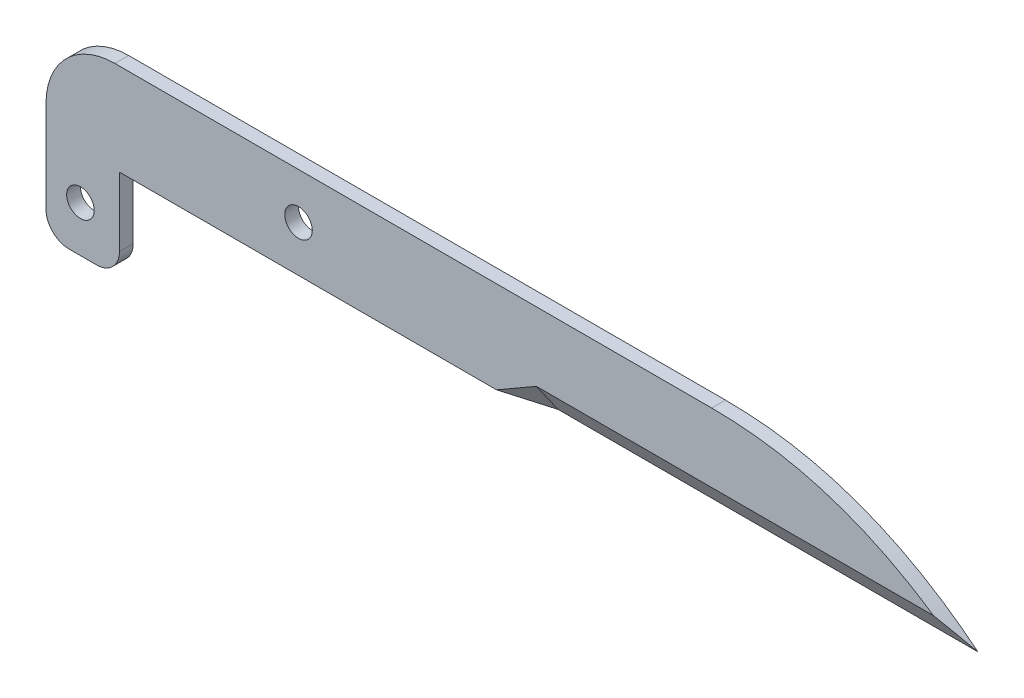
ISO-10303-21;
HEADER;
FILE_DESCRIPTION(('STEP AP214'),'2;1');
FILE_NAME('part.step','',(''),(''),'','','');
FILE_SCHEMA(('AUTOMOTIVE_DESIGN { 1 0 10303 214 1 1 1 1 }'));
ENDSEC;
DATA;
#1=APPLICATION_CONTEXT('core data for automotive mechanical design processes');
#2=APPLICATION_PROTOCOL_DEFINITION('international standard','automotive_design',2000,#1);
#3=PRODUCT_CONTEXT('',#1,'mechanical');
#4=PRODUCT('Part','Part','',(#3));
#5=PRODUCT_RELATED_PRODUCT_CATEGORY('part','',(#4));
#6=PRODUCT_DEFINITION_FORMATION('','',#4);
#7=PRODUCT_DEFINITION_CONTEXT('part definition',#1,'design');
#8=PRODUCT_DEFINITION('design','',#6,#7);
#9=PRODUCT_DEFINITION_SHAPE('','',#8);
#10=(LENGTH_UNIT() NAMED_UNIT(*) SI_UNIT(.MILLI.,.METRE.));
#11=(NAMED_UNIT(*) PLANE_ANGLE_UNIT() SI_UNIT($,.RADIAN.));
#12=(NAMED_UNIT(*) SI_UNIT($,.STERADIAN.) SOLID_ANGLE_UNIT());
#13=UNCERTAINTY_MEASURE_WITH_UNIT(LENGTH_MEASURE(1.E-05),#10,'distance_accuracy_value','');
#14=(GEOMETRIC_REPRESENTATION_CONTEXT(3) GLOBAL_UNCERTAINTY_ASSIGNED_CONTEXT((#13)) GLOBAL_UNIT_ASSIGNED_CONTEXT((#10,
#11,#12)) REPRESENTATION_CONTEXT('',''));
#15=CARTESIAN_POINT('',(0.,0.,0.));
#16=DIRECTION('',(0.,0.,1.));
#17=DIRECTION('',(1.,0.,0.));
#18=AXIS2_PLACEMENT_3D('',#15,#16,#17);
#19=CARTESIAN_POINT('',(-100.,-10.,3.));
#20=DIRECTION('',(1.,0.,0.));
#21=DIRECTION('',(0.,0.,-1.));
#22=AXIS2_PLACEMENT_3D('',#19,#20,#21);
#23=PLANE('',#22);
#24=DIRECTION('',(0.,-1.,0.));
#25=VECTOR('',#24,1.);
#26=CARTESIAN_POINT('',(-100.,-10.,0.));
#27=LINE('',#26,#25);
#28=CARTESIAN_POINT('',(-100.,-5.00000000000001,0.));
#29=VERTEX_POINT('',#28);
#30=CARTESIAN_POINT('',(-100.,-25.,0.));
#31=VERTEX_POINT('',#30);
#32=EDGE_CURVE('E131',#29,#31,#27,.T.);
#33=ORIENTED_EDGE('',*,*,#32,.T.);
#34=DIRECTION('',(0.,0.,1.));
#35=VECTOR('',#34,1.);
#36=CARTESIAN_POINT('',(-100.,-25.,3.));
#37=LINE('',#36,#35);
#38=CARTESIAN_POINT('',(-100.,-25.,3.));
#39=VERTEX_POINT('',#38);
#40=EDGE_CURVE('E198',#31,#39,#37,.T.);
#41=ORIENTED_EDGE('',*,*,#40,.T.);
#42=DIRECTION('',(0.,-1.,0.));
#43=VECTOR('',#42,1.);
#44=CARTESIAN_POINT('',(-100.,-10.,3.));
#45=LINE('',#44,#43);
#46=CARTESIAN_POINT('',(-100.,-5.00000000000001,3.));
#47=VERTEX_POINT('',#46);
#48=EDGE_CURVE('E227',#47,#39,#45,.T.);
#49=ORIENTED_EDGE('',*,*,#48,.F.);
#50=DIRECTION('',(0.,0.,-1.));
#51=VECTOR('',#50,1.);
#52=CARTESIAN_POINT('',(-100.,-5.00000000000001,3.));
#53=LINE('',#52,#51);
#54=EDGE_CURVE('E180',#47,#29,#53,.T.);
#55=ORIENTED_EDGE('',*,*,#54,.T.);
#56=EDGE_LOOP('',(#33,#41,#49,#55));
#57=FACE_BOUND('',#56,.T.);
#58=ADVANCED_FACE('F36',(#57),#23,.F.);
#59=CARTESIAN_POINT('',(100.,-9.99999999999999,3.));
#60=DIRECTION('',(0.,1.,0.));
#61=DIRECTION('',(-1.,0.,0.));
#62=AXIS2_PLACEMENT_3D('',#59,#60,#61);
#63=PLANE('',#62);
#64=DIRECTION('',(1.,0.,0.));
#65=VECTOR('',#64,1.);
#66=CARTESIAN_POINT('',(100.,-9.99999999999999,3.));
#67=LINE('',#66,#65);
#68=CARTESIAN_POINT('',(-84.,-10.,3.));
#69=VERTEX_POINT('',#68);
#70=CARTESIAN_POINT('',(-1.85640646055144,-10.,3.));
#71=VERTEX_POINT('',#70);
#72=EDGE_CURVE('E135',#69,#71,#67,.T.);
#73=ORIENTED_EDGE('',*,*,#72,.F.);
#74=DIRECTION('',(0.,0.,1.));
#75=VECTOR('',#74,1.);
#76=CARTESIAN_POINT('',(-84.,-10.,0.));
#77=LINE('',#76,#75);
#78=CARTESIAN_POINT('',(-84.,-10.,0.));
#79=VERTEX_POINT('',#78);
#80=EDGE_CURVE('E118',#79,#69,#77,.T.);
#81=ORIENTED_EDGE('',*,*,#80,.F.);
#82=DIRECTION('',(1.,0.,0.));
#83=VECTOR('',#82,1.);
#84=CARTESIAN_POINT('',(100.,-9.99999999999999,0.));
#85=LINE('',#84,#83);
#86=CARTESIAN_POINT('',(8.53589838486205,-10.,0.));
#87=VERTEX_POINT('',#86);
#88=EDGE_CURVE('E122',#79,#87,#85,.T.);
#89=ORIENTED_EDGE('',*,*,#88,.T.);
#90=DIRECTION('',(-0.960768922830524,0.,0.277350098112609));
#91=VECTOR('',#90,1.);
#92=CARTESIAN_POINT('',(7.68934801746655,-10.,0.244378041249178));
#93=LINE('',#92,#91);
#94=EDGE_CURVE('E283',#87,#71,#93,.T.);
#95=ORIENTED_EDGE('',*,*,#94,.T.);
#96=EDGE_LOOP('',(#73,#81,#89,#95));
#97=FACE_BOUND('',#96,.T.);
#98=ADVANCED_FACE('F134',(#97),#63,.F.);
#99=CARTESIAN_POINT('',(100.,10.,3.));
#100=DIRECTION('',(0.,-1.,0.));
#101=DIRECTION('',(1.,0.,0.));
#102=AXIS2_PLACEMENT_3D('',#99,#100,#101);
#103=PLANE('',#102);
#104=DIRECTION('',(-1.,0.,0.));
#105=VECTOR('',#104,1.);
#106=CARTESIAN_POINT('',(100.,10.,0.));
#107=LINE('',#106,#105);
#108=CARTESIAN_POINT('',(45.,10.,0.));
#109=VERTEX_POINT('',#108);
#110=CARTESIAN_POINT('',(-85.,9.99999999999999,0.));
#111=VERTEX_POINT('',#110);
#112=EDGE_CURVE('E130',#109,#111,#107,.T.);
#113=ORIENTED_EDGE('',*,*,#112,.T.);
#114=DIRECTION('',(0.,0.,-1.));
#115=VECTOR('',#114,1.);
#116=CARTESIAN_POINT('',(-85.,9.99999999999999,3.));
#117=LINE('',#116,#115);
#118=CARTESIAN_POINT('',(-85.,9.99999999999999,3.));
#119=VERTEX_POINT('',#118);
#120=EDGE_CURVE('E194',#111,#119,#117,.F.);
#121=ORIENTED_EDGE('',*,*,#120,.T.);
#122=DIRECTION('',(-1.,0.,0.));
#123=VECTOR('',#122,1.);
#124=CARTESIAN_POINT('',(100.,10.,3.));
#125=LINE('',#124,#123);
#126=CARTESIAN_POINT('',(45.,10.,3.));
#127=VERTEX_POINT('',#126);
#128=EDGE_CURVE('E280',#127,#119,#125,.T.);
#129=ORIENTED_EDGE('',*,*,#128,.F.);
#130=DIRECTION('',(0.,0.,1.));
#131=VECTOR('',#130,1.);
#132=CARTESIAN_POINT('',(45.,10.,0.));
#133=LINE('',#132,#131);
#134=EDGE_CURVE('E150',#109,#127,#133,.T.);
#135=ORIENTED_EDGE('',*,*,#134,.F.);
#136=EDGE_LOOP('',(#113,#121,#129,#135));
#137=FACE_BOUND('',#136,.T.);
#138=ADVANCED_FACE('F241',(#137),#103,.F.);
#139=CARTESIAN_POINT('',(0.,0.,3.));
#140=DIRECTION('',(0.,0.,1.));
#141=DIRECTION('',(1.,0.,0.));
#142=AXIS2_PLACEMENT_3D('',#139,#140,#141);
#143=PLANE('',#142);
#144=CARTESIAN_POINT('',(-92.5,-20.,3.));
#145=DIRECTION('',(0.,0.,1.));
#146=DIRECTION('',(1.,0.,0.));
#147=AXIS2_PLACEMENT_3D('',#144,#145,#146);
#148=CIRCLE('',#147,3.00000000000001);
#149=CARTESIAN_POINT('',(-89.5,-20.,3.));
#150=VERTEX_POINT('',#149);
#151=EDGE_CURVE('E189',#150,#150,#148,.T.);
#152=ORIENTED_EDGE('',*,*,#151,.F.);
#153=EDGE_LOOP('',(#152));
#154=FACE_BOUND('',#153,.T.);
#155=CARTESIAN_POINT('',(-45.,0.,3.));
#156=DIRECTION('',(0.,0.,1.));
#157=DIRECTION('',(1.,0.,0.));
#158=AXIS2_PLACEMENT_3D('',#155,#156,#157);
#159=CIRCLE('',#158,3.);
#160=CARTESIAN_POINT('',(-42.,0.,3.));
#161=VERTEX_POINT('',#160);
#162=EDGE_CURVE('E136',#161,#161,#159,.T.);
#163=ORIENTED_EDGE('',*,*,#162,.F.);
#164=EDGE_LOOP('',(#163));
#165=FACE_BOUND('',#164,.T.);
#166=ORIENTED_EDGE('',*,*,#48,.T.);
#167=CARTESIAN_POINT('',(-95.,-25.,3.));
#168=DIRECTION('',(0.,0.,1.));
#169=DIRECTION('',(1.,0.,0.));
#170=AXIS2_PLACEMENT_3D('',#167,#168,#169);
#171=CIRCLE('',#170,5.);
#172=CARTESIAN_POINT('',(-95.,-30.,3.));
#173=VERTEX_POINT('',#172);
#174=EDGE_CURVE('E203',#39,#173,#171,.T.);
#175=ORIENTED_EDGE('',*,*,#174,.T.);
#176=DIRECTION('',(1.,0.,0.));
#177=VECTOR('',#176,1.);
#178=CARTESIAN_POINT('',(-84.,-30.,3.));
#179=LINE('',#178,#177);
#180=CARTESIAN_POINT('',(-89.,-30.,3.));
#181=VERTEX_POINT('',#180);
#182=EDGE_CURVE('E188',#173,#181,#179,.T.);
#183=ORIENTED_EDGE('',*,*,#182,.T.);
#184=CARTESIAN_POINT('',(-89.,-25.,3.));
#185=DIRECTION('',(0.,0.,1.));
#186=DIRECTION('',(1.,0.,0.));
#187=AXIS2_PLACEMENT_3D('',#184,#185,#186);
#188=CIRCLE('',#187,5.);
#189=CARTESIAN_POINT('',(-84.,-25.,3.));
#190=VERTEX_POINT('',#189);
#191=EDGE_CURVE('E201',#181,#190,#188,.T.);
#192=ORIENTED_EDGE('',*,*,#191,.T.);
#193=DIRECTION('',(0.,1.,0.));
#194=VECTOR('',#193,1.);
#195=CARTESIAN_POINT('',(-84.,-10.,3.));
#196=LINE('',#195,#194);
#197=EDGE_CURVE('E142',#190,#69,#196,.T.);
#198=ORIENTED_EDGE('',*,*,#197,.T.);
#199=ORIENTED_EDGE('',*,*,#72,.T.);
#200=DIRECTION('',(0.866025403784442,0.499999999999995,0.));
#201=VECTOR('',#200,1.);
#202=CARTESIAN_POINT('',(17.1961524227068,1.00000000000016,3.));
#203=LINE('',#202,#201);
#204=CARTESIAN_POINT('',(6.8038475772931,-4.99999999999999,3.));
#205=VERTEX_POINT('',#204);
#206=EDGE_CURVE('E279',#71,#205,#203,.T.);
#207=ORIENTED_EDGE('',*,*,#206,.T.);
#208=DIRECTION('',(1.,0.,0.));
#209=VECTOR('',#208,1.);
#210=CARTESIAN_POINT('',(7.58369917665432,-4.99999999999999,3.));
#211=LINE('',#210,#209);
#212=CARTESIAN_POINT('',(93.2793927289065,-4.99999999999999,3.));
#213=VERTEX_POINT('',#212);
#214=EDGE_CURVE('E220',#205,#213,#211,.T.);
#215=ORIENTED_EDGE('',*,*,#214,.T.);
#216=CARTESIAN_POINT('',(45.,10.,3.));
#217=CARTESIAN_POINT('',(75.292472646712,10.,3.));
#218=CARTESIAN_POINT('',(100.,-9.99999999999999,3.));
#219=B_SPLINE_CURVE_WITH_KNOTS('',2,(#216,#217,#218),.UNSPECIFIED.,.F.,.F.,(3,3),(0.,1.),.UNSPECIFIED.);
#220=EDGE_CURVE('E151',#127,#213,#219,.T.);
#221=ORIENTED_EDGE('',*,*,#220,.F.);
#222=ORIENTED_EDGE('',*,*,#128,.T.);
#223=CARTESIAN_POINT('',(-85.,-5.00000000000001,3.));
#224=DIRECTION('',(0.,0.,1.));
#225=DIRECTION('',(1.,0.,0.));
#226=AXIS2_PLACEMENT_3D('',#223,#224,#225);
#227=CIRCLE('',#226,15.);
#228=EDGE_CURVE('E196',#119,#47,#227,.T.);
#229=ORIENTED_EDGE('',*,*,#228,.T.);
#230=EDGE_LOOP('',(#166,#175,#183,#192,#198,#199,#207,#215,#221,#222,#229));
#231=FACE_BOUND('',#230,.T.);
#232=ADVANCED_FACE('F226',(#154,#165,#231),#143,.T.);
#233=CARTESIAN_POINT('',(0.,0.,0.));
#234=DIRECTION('',(0.,0.,1.));
#235=DIRECTION('',(1.,0.,0.));
#236=AXIS2_PLACEMENT_3D('',#233,#234,#235);
#237=PLANE('',#236);
#238=CARTESIAN_POINT('',(-92.5,-20.,0.));
#239=DIRECTION('',(0.,0.,1.));
#240=DIRECTION('',(1.,0.,0.));
#241=AXIS2_PLACEMENT_3D('',#238,#239,#240);
#242=CIRCLE('',#241,3.00000000000001);
#243=CARTESIAN_POINT('',(-89.5,-20.,0.));
#244=VERTEX_POINT('',#243);
#245=EDGE_CURVE('E185',#244,#244,#242,.T.);
#246=ORIENTED_EDGE('',*,*,#245,.T.);
#247=EDGE_LOOP('',(#246));
#248=FACE_BOUND('',#247,.T.);
#249=CARTESIAN_POINT('',(-45.,0.,0.));
#250=DIRECTION('',(0.,0.,1.));
#251=DIRECTION('',(1.,0.,0.));
#252=AXIS2_PLACEMENT_3D('',#249,#250,#251);
#253=CIRCLE('',#252,3.);
#254=CARTESIAN_POINT('',(-42.,0.,0.));
#255=VERTEX_POINT('',#254);
#256=EDGE_CURVE('E139',#255,#255,#253,.T.);
#257=ORIENTED_EDGE('',*,*,#256,.T.);
#258=EDGE_LOOP('',(#257));
#259=FACE_BOUND('',#258,.T.);
#260=DIRECTION('',(1.,0.,0.));
#261=VECTOR('',#260,1.);
#262=CARTESIAN_POINT('',(-84.,-30.,0.));
#263=LINE('',#262,#261);
#264=CARTESIAN_POINT('',(-95.,-30.,0.));
#265=VERTEX_POINT('',#264);
#266=CARTESIAN_POINT('',(-89.,-30.,0.));
#267=VERTEX_POINT('',#266);
#268=EDGE_CURVE('E119',#265,#267,#263,.T.);
#269=ORIENTED_EDGE('',*,*,#268,.F.);
#270=CARTESIAN_POINT('',(-95.,-25.,0.));
#271=DIRECTION('',(0.,0.,1.));
#272=DIRECTION('',(1.,0.,0.));
#273=AXIS2_PLACEMENT_3D('',#270,#271,#272);
#274=CIRCLE('',#273,5.);
#275=EDGE_CURVE('E44',#265,#31,#274,.F.);
#276=ORIENTED_EDGE('',*,*,#275,.T.);
#277=ORIENTED_EDGE('',*,*,#32,.F.);
#278=CARTESIAN_POINT('',(-85.,-5.00000000000001,0.));
#279=DIRECTION('',(0.,0.,1.));
#280=DIRECTION('',(1.,0.,0.));
#281=AXIS2_PLACEMENT_3D('',#278,#279,#280);
#282=CIRCLE('',#281,15.);
#283=EDGE_CURVE('E192',#29,#111,#282,.F.);
#284=ORIENTED_EDGE('',*,*,#283,.T.);
#285=ORIENTED_EDGE('',*,*,#112,.F.);
#286=CARTESIAN_POINT('',(45.,10.,0.));
#287=CARTESIAN_POINT('',(75.292472646712,10.,0.));
#288=CARTESIAN_POINT('',(100.,-9.99999999999999,0.));
#289=B_SPLINE_CURVE_WITH_KNOTS('',2,(#286,#287,#288),.UNSPECIFIED.,.F.,.F.,(3,3),(0.,1.),.UNSPECIFIED.);
#290=CARTESIAN_POINT('',(100.,-9.99999999999999,0.));
#291=VERTEX_POINT('',#290);
#292=EDGE_CURVE('E145',#109,#291,#289,.T.);
#293=ORIENTED_EDGE('',*,*,#292,.T.);
#294=DIRECTION('',(1.,0.,0.));
#295=VECTOR('',#294,1.);
#296=CARTESIAN_POINT('',(7.58369917665432,-9.99999999999999,0.));
#297=LINE('',#296,#295);
#298=EDGE_CURVE('E126',#87,#291,#297,.T.);
#299=ORIENTED_EDGE('',*,*,#298,.F.);
#300=ORIENTED_EDGE('',*,*,#88,.F.);
#301=DIRECTION('',(0.,1.,0.));
#302=VECTOR('',#301,1.);
#303=CARTESIAN_POINT('',(-84.,-10.,0.));
#304=LINE('',#303,#302);
#305=CARTESIAN_POINT('',(-84.,-25.,0.));
#306=VERTEX_POINT('',#305);
#307=EDGE_CURVE('E114',#306,#79,#304,.T.);
#308=ORIENTED_EDGE('',*,*,#307,.F.);
#309=CARTESIAN_POINT('',(-89.,-25.,0.));
#310=DIRECTION('',(0.,0.,1.));
#311=DIRECTION('',(1.,0.,0.));
#312=AXIS2_PLACEMENT_3D('',#309,#310,#311);
#313=CIRCLE('',#312,5.);
#314=EDGE_CURVE('E56',#306,#267,#313,.F.);
#315=ORIENTED_EDGE('',*,*,#314,.T.);
#316=EDGE_LOOP('',(#269,#276,#277,#284,#285,#293,#299,#300,#308,#315));
#317=FACE_BOUND('',#316,.T.);
#318=ADVANCED_FACE('F123',(#248,#259,#317),#237,.F.);
#319=CARTESIAN_POINT('',(7.58369917665432,-4.99999999999999,3.));
#320=DIRECTION('',(0.,0.514495755427526,-0.857492925712544));
#321=DIRECTION('',(0.,0.857492925712544,0.514495755427526));
#322=AXIS2_PLACEMENT_3D('',#319,#320,#321);
#323=PLANE('',#322);
#324=ORIENTED_EDGE('',*,*,#298,.T.);
#325=CARTESIAN_POINT('',(100.,-9.99999999999999,0.));
#326=CARTESIAN_POINT('',(99.7841714407898,-9.82529329993253,0.104824020040473));
#327=CARTESIAN_POINT('',(99.5675257842605,-9.65132845301331,0.20920292819201));
#328=CARTESIAN_POINT('',(99.1326541730535,-9.30496428032895,0.417021431802626));
#329=CARTESIAN_POINT('',(98.9144286862377,-9.13256452262411,0.520461286425529));
#330=CARTESIAN_POINT('',(98.4763762796063,-8.78935031814869,0.726389809110777));
#331=CARTESIAN_POINT('',(98.2565497208114,-8.61853553260538,0.828878680436768));
#332=CARTESIAN_POINT('',(97.8152736979127,-8.27851165502291,1.03289300698625));
#333=CARTESIAN_POINT('',(97.5938244824415,-8.10930232574229,1.13441860455462));
#334=CARTESIAN_POINT('',(97.149281147805,-7.77251016314403,1.33649390211357));
#335=CARTESIAN_POINT('',(96.9261871592369,-7.60492720308662,1.43704367814802));
#336=CARTESIAN_POINT('',(96.4783273420771,-7.27140575730393,1.63715654561764));
#337=CARTESIAN_POINT('',(96.253561487149,-7.10546729758047,1.73671962145172));
#338=CARTESIAN_POINT('',(95.8023403674953,-6.77526078697559,1.93484352781464));
#339=CARTESIAN_POINT('',(95.5758849877601,-6.61099285164258,2.03340428901445));
#340=CARTESIAN_POINT('',(95.121262457311,-6.28415048594628,2.22950970843223));
#341=CARTESIAN_POINT('',(94.8930950643859,-6.12157630328964,2.32705421802621));
#342=CARTESIAN_POINT('',(94.4350255939571,-5.79814501350999,2.521112991894));
#343=CARTESIAN_POINT('',(94.2051231411372,-5.63728829719111,2.61762702168533));
#344=CARTESIAN_POINT('',(93.7435603464156,-5.31731614407106,2.80961031355736));
#345=CARTESIAN_POINT('',(93.511899490171,-5.15820125283875,2.90507924829674));
#346=CARTESIAN_POINT('',(93.2793927409277,-5.,2.99999999999999));
#347=B_SPLINE_CURVE_WITH_KNOTS('',3,(#325,#326,#327,#328,#329,#330,#331,#332,#333,#334,#335,
#336,#337,#338,#339,#340,#341,#342,#343,#344,#345,#346),.UNSPECIFIED.,.F.,.F.,(4,2,2,2,2,2,2,2,
2,2,4),(0.,0.890409335986902,1.78056496817661,2.67052573993626,3.5603528854447,4.45011012247714,
5.33988140541811,6.22971381992445,7.11967459299462,8.00983373364461,8.9002641380797),.UNSPECIFIED.);
#348=EDGE_CURVE('E172',#291,#213,#347,.T.);
#349=ORIENTED_EDGE('',*,*,#348,.T.);
#350=ORIENTED_EDGE('',*,*,#214,.F.);
#351=DIRECTION('',(0.284747398725762,-0.821994936526783,-0.49319696191607));
#352=VECTOR('',#351,1.);
#353=CARTESIAN_POINT('',(6.86707878805212,-5.18253278276452,2.89048033034128));
#354=LINE('',#353,#352);
#355=EDGE_CURVE('E181',#205,#87,#354,.T.);
#356=ORIENTED_EDGE('',*,*,#355,.T.);
#357=EDGE_LOOP('',(#324,#349,#350,#356));
#358=FACE_BOUND('',#357,.T.);
#359=ADVANCED_FACE('F168',(#358),#323,.F.);
#360=CARTESIAN_POINT('',(7.3301270189221,-12.6961524227067,-1.00000000000005));
#361=DIRECTION('',(0.249999999999995,-0.433012701892218,0.866025403784441));
#362=DIRECTION('',(0.866025403784442,0.499999999999995,0.));
#363=AXIS2_PLACEMENT_3D('',#360,#361,#362);
#364=PLANE('',#363);
#365=ORIENTED_EDGE('',*,*,#355,.F.);
#366=ORIENTED_EDGE('',*,*,#206,.F.);
#367=ORIENTED_EDGE('',*,*,#94,.F.);
#368=EDGE_LOOP('',(#365,#366,#367));
#369=FACE_BOUND('',#368,.T.);
#370=ADVANCED_FACE('F165',(#369),#364,.T.);
#371=DIRECTION('',(0.,0.,1.));
#372=VECTOR('',#371,1.);
#373=SURFACE_OF_LINEAR_EXTRUSION('',#289,#372);
#374=ORIENTED_EDGE('',*,*,#292,.F.);
#375=ORIENTED_EDGE('',*,*,#134,.T.);
#376=ORIENTED_EDGE('',*,*,#220,.T.);
#377=ORIENTED_EDGE('',*,*,#348,.F.);
#378=EDGE_LOOP('',(#374,#375,#376,#377));
#379=FACE_BOUND('',#378,.T.);
#380=ADVANCED_FACE('F159',(#379),#373,.F.);
#381=CARTESIAN_POINT('',(-45.,0.,-1.));
#382=DIRECTION('',(0.,0.,1.));
#383=DIRECTION('',(1.,0.,0.));
#384=AXIS2_PLACEMENT_3D('',#381,#382,#383);
#385=CYLINDRICAL_SURFACE('',#384,3.);
#386=ORIENTED_EDGE('',*,*,#162,.T.);
#387=EDGE_LOOP('',(#386));
#388=FACE_BOUND('',#387,.T.);
#389=ORIENTED_EDGE('',*,*,#256,.F.);
#390=EDGE_LOOP('',(#389));
#391=FACE_BOUND('',#390,.T.);
#392=ADVANCED_FACE('F164',(#388,#391),#385,.F.);
#393=CARTESIAN_POINT('',(-84.,-30.,0.));
#394=DIRECTION('',(0.,-1.,0.));
#395=DIRECTION('',(1.,0.,0.));
#396=AXIS2_PLACEMENT_3D('',#393,#394,#395);
#397=PLANE('',#396);
#398=ORIENTED_EDGE('',*,*,#182,.F.);
#399=DIRECTION('',(0.,0.,1.));
#400=VECTOR('',#399,1.);
#401=CARTESIAN_POINT('',(-95.,-30.,0.));
#402=LINE('',#401,#400);
#403=EDGE_CURVE('E208',#173,#265,#402,.F.);
#404=ORIENTED_EDGE('',*,*,#403,.T.);
#405=ORIENTED_EDGE('',*,*,#268,.T.);
#406=DIRECTION('',(0.,0.,1.));
#407=VECTOR('',#406,1.);
#408=CARTESIAN_POINT('',(-89.,-30.,0.));
#409=LINE('',#408,#407);
#410=EDGE_CURVE('E205',#267,#181,#409,.T.);
#411=ORIENTED_EDGE('',*,*,#410,.T.);
#412=EDGE_LOOP('',(#398,#404,#405,#411));
#413=FACE_BOUND('',#412,.T.);
#414=ADVANCED_FACE('F229',(#413),#397,.T.);
#415=CARTESIAN_POINT('',(-84.,-10.,0.));
#416=DIRECTION('',(1.,0.,0.));
#417=DIRECTION('',(0.,1.,0.));
#418=AXIS2_PLACEMENT_3D('',#415,#416,#417);
#419=PLANE('',#418);
#420=ORIENTED_EDGE('',*,*,#197,.F.);
#421=DIRECTION('',(0.,0.,1.));
#422=VECTOR('',#421,1.);
#423=CARTESIAN_POINT('',(-84.,-25.,0.));
#424=LINE('',#423,#422);
#425=EDGE_CURVE('E11',#190,#306,#424,.F.);
#426=ORIENTED_EDGE('',*,*,#425,.T.);
#427=ORIENTED_EDGE('',*,*,#307,.T.);
#428=ORIENTED_EDGE('',*,*,#80,.T.);
#429=EDGE_LOOP('',(#420,#426,#427,#428));
#430=FACE_BOUND('',#429,.T.);
#431=ADVANCED_FACE('F116',(#430),#419,.T.);
#432=CARTESIAN_POINT('',(-92.5,-20.,-7.));
#433=DIRECTION('',(0.,0.,1.));
#434=DIRECTION('',(1.,0.,0.));
#435=AXIS2_PLACEMENT_3D('',#432,#433,#434);
#436=CYLINDRICAL_SURFACE('',#435,3.00000000000001);
#437=ORIENTED_EDGE('',*,*,#151,.T.);
#438=EDGE_LOOP('',(#437));
#439=FACE_BOUND('',#438,.T.);
#440=ORIENTED_EDGE('',*,*,#245,.F.);
#441=EDGE_LOOP('',(#440));
#442=FACE_BOUND('',#441,.T.);
#443=ADVANCED_FACE('F236',(#439,#442),#436,.F.);
#444=CARTESIAN_POINT('',(-85.,-5.00000000000001,3.));
#445=DIRECTION('',(0.,0.,-1.));
#446=DIRECTION('',(-1.,0.,0.));
#447=AXIS2_PLACEMENT_3D('',#444,#445,#446);
#448=CYLINDRICAL_SURFACE('',#447,15.);
#449=ORIENTED_EDGE('',*,*,#228,.F.);
#450=ORIENTED_EDGE('',*,*,#120,.F.);
#451=ORIENTED_EDGE('',*,*,#283,.F.);
#452=ORIENTED_EDGE('',*,*,#54,.F.);
#453=EDGE_LOOP('',(#449,#450,#451,#452));
#454=FACE_BOUND('',#453,.T.);
#455=ADVANCED_FACE('F266',(#454),#448,.T.);
#456=CARTESIAN_POINT('',(-95.,-25.,3.));
#457=DIRECTION('',(0.,0.,-1.));
#458=DIRECTION('',(-1.,0.,0.));
#459=AXIS2_PLACEMENT_3D('',#456,#457,#458);
#460=CYLINDRICAL_SURFACE('',#459,5.);
#461=ORIENTED_EDGE('',*,*,#275,.F.);
#462=ORIENTED_EDGE('',*,*,#403,.F.);
#463=ORIENTED_EDGE('',*,*,#174,.F.);
#464=ORIENTED_EDGE('',*,*,#40,.F.);
#465=EDGE_LOOP('',(#461,#462,#463,#464));
#466=FACE_BOUND('',#465,.T.);
#467=ADVANCED_FACE('F222',(#466),#460,.T.);
#468=CARTESIAN_POINT('',(-89.,-25.,0.));
#469=DIRECTION('',(0.,0.,1.));
#470=DIRECTION('',(1.,0.,0.));
#471=AXIS2_PLACEMENT_3D('',#468,#469,#470);
#472=CYLINDRICAL_SURFACE('',#471,5.);
#473=ORIENTED_EDGE('',*,*,#314,.F.);
#474=ORIENTED_EDGE('',*,*,#425,.F.);
#475=ORIENTED_EDGE('',*,*,#191,.F.);
#476=ORIENTED_EDGE('',*,*,#410,.F.);
#477=EDGE_LOOP('',(#473,#474,#475,#476));
#478=FACE_BOUND('',#477,.T.);
#479=ADVANCED_FACE('F38',(#478),#472,.T.);
#480=CLOSED_SHELL('',(#58,#98,#138,#232,#318,#359,#370,#380,#392,#414,#431,#443,#455,#467,#479));
#481=MANIFOLD_SOLID_BREP('B2',#480);
#482=ADVANCED_BREP_SHAPE_REPRESENTATION('',(#18,#481),#14);
#483=SHAPE_DEFINITION_REPRESENTATION(#9,#482);
ENDSEC;
END-ISO-10303-21;
